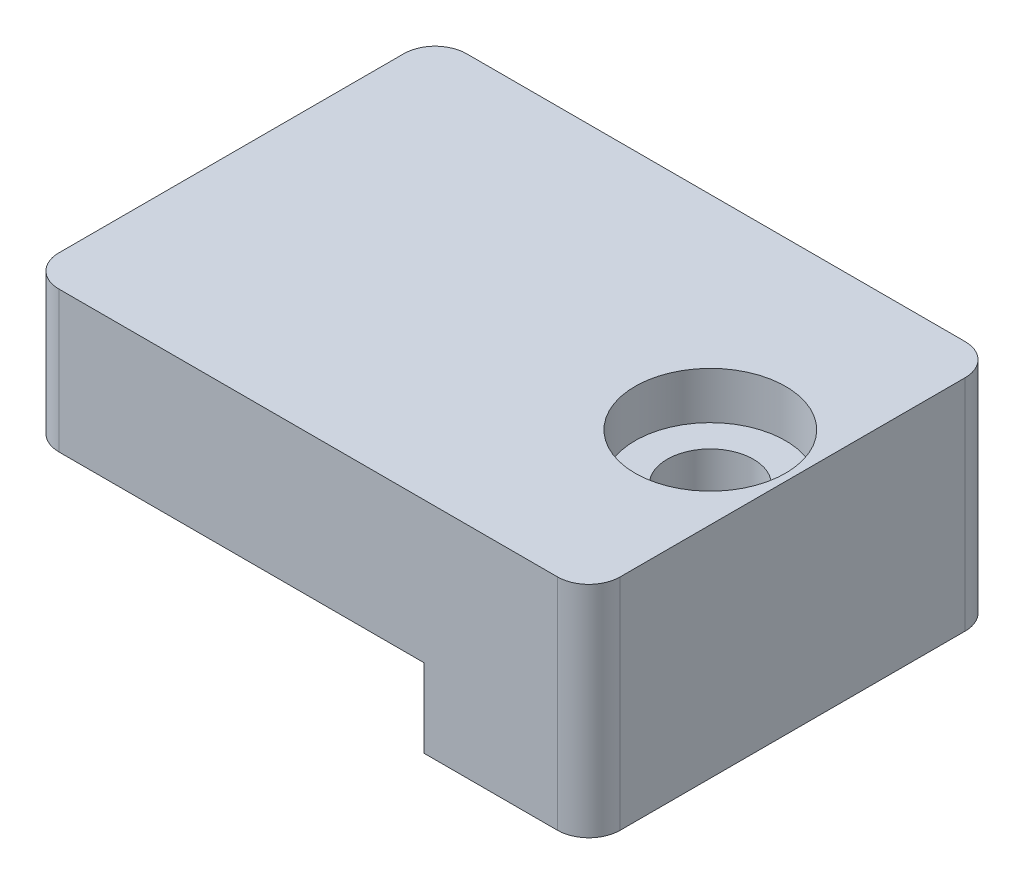
ISO-10303-21;
HEADER;
FILE_DESCRIPTION(('STEP AP214'),'2;1');
FILE_NAME('part.step','',(''),(''),'','','');
FILE_SCHEMA(('AUTOMOTIVE_DESIGN { 1 0 10303 214 1 1 1 1 }'));
ENDSEC;
DATA;
#1=APPLICATION_CONTEXT('core data for automotive mechanical design processes');
#2=APPLICATION_PROTOCOL_DEFINITION('international standard','automotive_design',2000,#1);
#3=PRODUCT_CONTEXT('',#1,'mechanical');
#4=PRODUCT('Part','Part','',(#3));
#5=PRODUCT_RELATED_PRODUCT_CATEGORY('part','',(#4));
#6=PRODUCT_DEFINITION_FORMATION('','',#4);
#7=PRODUCT_DEFINITION_CONTEXT('part definition',#1,'design');
#8=PRODUCT_DEFINITION('design','',#6,#7);
#9=PRODUCT_DEFINITION_SHAPE('','',#8);
#10=(LENGTH_UNIT() NAMED_UNIT(*) SI_UNIT(.MILLI.,.METRE.));
#11=(NAMED_UNIT(*) PLANE_ANGLE_UNIT() SI_UNIT($,.RADIAN.));
#12=(NAMED_UNIT(*) SI_UNIT($,.STERADIAN.) SOLID_ANGLE_UNIT());
#13=UNCERTAINTY_MEASURE_WITH_UNIT(LENGTH_MEASURE(1.E-05),#10,'distance_accuracy_value','');
#14=(GEOMETRIC_REPRESENTATION_CONTEXT(3) GLOBAL_UNCERTAINTY_ASSIGNED_CONTEXT((#13)) GLOBAL_UNIT_ASSIGNED_CONTEXT((#10,
#11,#12)) REPRESENTATION_CONTEXT('',''));
#15=CARTESIAN_POINT('',(0.,0.,0.));
#16=DIRECTION('',(0.,0.,1.));
#17=DIRECTION('',(1.,0.,0.));
#18=AXIS2_PLACEMENT_3D('',#15,#16,#17);
#19=CARTESIAN_POINT('',(-25.3,-9.,26.));
#20=DIRECTION('',(0.,1.,0.));
#21=DIRECTION('',(0.,0.,1.));
#22=AXIS2_PLACEMENT_3D('',#19,#20,#21);
#23=PLANE('',#22);
#24=DIRECTION('',(0.,0.,1.));
#25=VECTOR('',#24,1.);
#26=CARTESIAN_POINT('',(-2.,-9.,0.));
#27=LINE('',#26,#25);
#28=CARTESIAN_POINT('',(-2.,-9.,8.175));
#29=VERTEX_POINT('',#28);
#30=CARTESIAN_POINT('',(-2.,-9.,17.825));
#31=VERTEX_POINT('',#30);
#32=EDGE_CURVE('E350',#29,#31,#27,.T.);
#33=ORIENTED_EDGE('',*,*,#32,.F.);
#34=CARTESIAN_POINT('',(-5.175,-9.,8.175));
#35=DIRECTION('',(0.,1.,0.));
#36=DIRECTION('',(0.,0.,1.));
#37=AXIS2_PLACEMENT_3D('',#34,#35,#36);
#38=CIRCLE('',#37,3.175);
#39=CARTESIAN_POINT('',(-5.175,-9.,5.));
#40=VERTEX_POINT('',#39);
#41=EDGE_CURVE('E72',#29,#40,#38,.T.);
#42=ORIENTED_EDGE('',*,*,#41,.T.);
#43=DIRECTION('',(-1.,0.,0.));
#44=VECTOR('',#43,1.);
#45=CARTESIAN_POINT('',(-2.,-9.,5.));
#46=LINE('',#45,#44);
#47=CARTESIAN_POINT('',(-25.3,-9.,5.));
#48=VERTEX_POINT('',#47);
#49=EDGE_CURVE('E347',#40,#48,#46,.T.);
#50=ORIENTED_EDGE('',*,*,#49,.T.);
#51=DIRECTION('',(0.,0.,-1.));
#52=VECTOR('',#51,1.);
#53=CARTESIAN_POINT('',(-25.3,-9.,26.));
#54=LINE('',#53,#52);
#55=CARTESIAN_POINT('',(-25.3,-9.,2.00000000000001));
#56=VERTEX_POINT('',#55);
#57=EDGE_CURVE('E238',#48,#56,#54,.T.);
#58=ORIENTED_EDGE('',*,*,#57,.T.);
#59=CARTESIAN_POINT('',(-23.3,-9.,2.));
#60=DIRECTION('',(0.,1.,0.));
#61=DIRECTION('',(0.,0.,1.));
#62=AXIS2_PLACEMENT_3D('',#59,#60,#61);
#63=CIRCLE('',#62,2.);
#64=CARTESIAN_POINT('',(-23.3,-9.,0.));
#65=VERTEX_POINT('',#64);
#66=EDGE_CURVE('E296',#56,#65,#63,.F.);
#67=ORIENTED_EDGE('',*,*,#66,.T.);
#68=DIRECTION('',(1.,0.,0.));
#69=VECTOR('',#68,1.);
#70=CARTESIAN_POINT('',(-25.3,-9.,0.));
#71=LINE('',#70,#69);
#72=CARTESIAN_POINT('',(0.,-9.,0.));
#73=VERTEX_POINT('',#72);
#74=EDGE_CURVE('E431',#65,#73,#71,.T.);
#75=ORIENTED_EDGE('',*,*,#74,.T.);
#76=DIRECTION('',(0.,0.,-1.));
#77=VECTOR('',#76,1.);
#78=CARTESIAN_POINT('',(0.,-9.,26.));
#79=LINE('',#78,#77);
#80=CARTESIAN_POINT('',(0.,-9.,26.));
#81=VERTEX_POINT('',#80);
#82=EDGE_CURVE('E245',#81,#73,#79,.T.);
#83=ORIENTED_EDGE('',*,*,#82,.F.);
#84=DIRECTION('',(1.,0.,0.));
#85=VECTOR('',#84,1.);
#86=CARTESIAN_POINT('',(-25.3,-9.,26.));
#87=LINE('',#86,#85);
#88=CARTESIAN_POINT('',(-23.3,-9.,26.));
#89=VERTEX_POINT('',#88);
#90=EDGE_CURVE('E436',#89,#81,#87,.T.);
#91=ORIENTED_EDGE('',*,*,#90,.F.);
#92=CARTESIAN_POINT('',(-23.3,-9.,24.));
#93=DIRECTION('',(0.,1.,0.));
#94=DIRECTION('',(0.,0.,1.));
#95=AXIS2_PLACEMENT_3D('',#92,#93,#94);
#96=CIRCLE('',#95,2.);
#97=CARTESIAN_POINT('',(-25.3,-9.,24.));
#98=VERTEX_POINT('',#97);
#99=EDGE_CURVE('E235',#89,#98,#96,.F.);
#100=ORIENTED_EDGE('',*,*,#99,.T.);
#101=CARTESIAN_POINT('',(-25.3,-9.,21.));
#102=VERTEX_POINT('',#101);
#103=EDGE_CURVE('E225',#98,#102,#54,.T.);
#104=ORIENTED_EDGE('',*,*,#103,.T.);
#105=DIRECTION('',(-1.,0.,0.));
#106=VECTOR('',#105,1.);
#107=CARTESIAN_POINT('',(-2.,-9.,21.));
#108=LINE('',#107,#106);
#109=CARTESIAN_POINT('',(-5.175,-9.,21.));
#110=VERTEX_POINT('',#109);
#111=EDGE_CURVE('E210',#110,#102,#108,.T.);
#112=ORIENTED_EDGE('',*,*,#111,.F.);
#113=CARTESIAN_POINT('',(-5.175,-9.,17.825));
#114=DIRECTION('',(0.,1.,0.));
#115=DIRECTION('',(0.,0.,1.));
#116=AXIS2_PLACEMENT_3D('',#113,#114,#115);
#117=CIRCLE('',#116,3.175);
#118=EDGE_CURVE('E12',#110,#31,#117,.T.);
#119=ORIENTED_EDGE('',*,*,#118,.T.);
#120=EDGE_LOOP('',(#33,#42,#50,#58,#67,#75,#83,#91,#100,#104,#112,#119));
#121=FACE_BOUND('',#120,.T.);
#122=ADVANCED_FACE('F63',(#121),#23,.F.);
#123=CARTESIAN_POINT('',(-25.3,0.,26.));
#124=DIRECTION('',(1.,0.,0.));
#125=DIRECTION('',(0.,0.,-1.));
#126=AXIS2_PLACEMENT_3D('',#123,#124,#125);
#127=PLANE('',#126);
#128=DIRECTION('',(0.,0.,1.));
#129=VECTOR('',#128,1.);
#130=CARTESIAN_POINT('',(-25.3,-6.45,0.));
#131=LINE('',#130,#129);
#132=CARTESIAN_POINT('',(-25.3,-6.45,17.375));
#133=VERTEX_POINT('',#132);
#134=CARTESIAN_POINT('',(-25.3,-6.45,21.));
#135=VERTEX_POINT('',#134);
#136=EDGE_CURVE('E229',#133,#135,#131,.T.);
#137=ORIENTED_EDGE('',*,*,#136,.T.);
#138=DIRECTION('',(0.,1.,0.));
#139=VECTOR('',#138,1.);
#140=CARTESIAN_POINT('',(-25.3,0.,21.));
#141=LINE('',#140,#139);
#142=EDGE_CURVE('E213',#102,#135,#141,.T.);
#143=ORIENTED_EDGE('',*,*,#142,.F.);
#144=ORIENTED_EDGE('',*,*,#103,.F.);
#145=DIRECTION('',(0.,-1.,0.));
#146=VECTOR('',#145,1.);
#147=CARTESIAN_POINT('',(-25.3,0.,24.));
#148=LINE('',#147,#146);
#149=CARTESIAN_POINT('',(-25.3,0.,24.));
#150=VERTEX_POINT('',#149);
#151=EDGE_CURVE('E287',#98,#150,#148,.F.);
#152=ORIENTED_EDGE('',*,*,#151,.T.);
#153=DIRECTION('',(0.,0.,-1.));
#154=VECTOR('',#153,1.);
#155=CARTESIAN_POINT('',(-25.3,0.,26.));
#156=LINE('',#155,#154);
#157=CARTESIAN_POINT('',(-25.3,0.,2.00000000000001));
#158=VERTEX_POINT('',#157);
#159=EDGE_CURVE('E237',#150,#158,#156,.T.);
#160=ORIENTED_EDGE('',*,*,#159,.T.);
#161=DIRECTION('',(0.,-1.,0.));
#162=VECTOR('',#161,1.);
#163=CARTESIAN_POINT('',(-25.3,0.,2.));
#164=LINE('',#163,#162);
#165=EDGE_CURVE('E290',#158,#56,#164,.T.);
#166=ORIENTED_EDGE('',*,*,#165,.T.);
#167=ORIENTED_EDGE('',*,*,#57,.F.);
#168=DIRECTION('',(0.,1.,0.));
#169=VECTOR('',#168,1.);
#170=CARTESIAN_POINT('',(-25.3,0.,5.));
#171=LINE('',#170,#169);
#172=CARTESIAN_POINT('',(-25.3,-6.45,5.));
#173=VERTEX_POINT('',#172);
#174=EDGE_CURVE('E358',#48,#173,#171,.T.);
#175=ORIENTED_EDGE('',*,*,#174,.T.);
#176=CARTESIAN_POINT('',(-25.3,-6.45,8.625));
#177=VERTEX_POINT('',#176);
#178=EDGE_CURVE('E380',#173,#177,#131,.T.);
#179=ORIENTED_EDGE('',*,*,#178,.T.);
#180=DIRECTION('',(0.,1.,0.));
#181=VECTOR('',#180,1.);
#182=CARTESIAN_POINT('',(-25.3,-6.45,8.625));
#183=LINE('',#182,#181);
#184=CARTESIAN_POINT('',(-25.3,-2.25,8.625));
#185=VERTEX_POINT('',#184);
#186=EDGE_CURVE('E396',#177,#185,#183,.T.);
#187=ORIENTED_EDGE('',*,*,#186,.T.);
#188=DIRECTION('',(0.,0.,1.));
#189=VECTOR('',#188,1.);
#190=CARTESIAN_POINT('',(-25.3,-2.25,8.625));
#191=LINE('',#190,#189);
#192=CARTESIAN_POINT('',(-25.3,-2.25,17.375));
#193=VERTEX_POINT('',#192);
#194=EDGE_CURVE('E400',#185,#193,#191,.T.);
#195=ORIENTED_EDGE('',*,*,#194,.T.);
#196=DIRECTION('',(0.,-1.,0.));
#197=VECTOR('',#196,1.);
#198=CARTESIAN_POINT('',(-25.3,-2.25,17.375));
#199=LINE('',#198,#197);
#200=EDGE_CURVE('E395',#193,#133,#199,.T.);
#201=ORIENTED_EDGE('',*,*,#200,.T.);
#202=EDGE_LOOP('',(#137,#143,#144,#152,#160,#166,#167,#175,#179,#187,#195,#201));
#203=FACE_BOUND('',#202,.T.);
#204=ADVANCED_FACE('F224',(#203),#127,.F.);
#205=CARTESIAN_POINT('',(0.,-9.,26.));
#206=DIRECTION('',(1.,0.,0.));
#207=DIRECTION('',(0.,1.,0.));
#208=AXIS2_PLACEMENT_3D('',#205,#206,#207);
#209=PLANE('',#208);
#210=DIRECTION('',(0.,-1.,0.));
#211=VECTOR('',#210,1.);
#212=CARTESIAN_POINT('',(0.,-9.,0.));
#213=LINE('',#212,#211);
#214=CARTESIAN_POINT('',(0.,-14.,0.));
#215=VERTEX_POINT('',#214);
#216=EDGE_CURVE('E450',#73,#215,#213,.T.);
#217=ORIENTED_EDGE('',*,*,#216,.T.);
#218=DIRECTION('',(0.,0.,-1.));
#219=VECTOR('',#218,1.);
#220=CARTESIAN_POINT('',(0.,-14.,26.));
#221=LINE('',#220,#219);
#222=CARTESIAN_POINT('',(0.,-14.,26.));
#223=VERTEX_POINT('',#222);
#224=EDGE_CURVE('E466',#223,#215,#221,.T.);
#225=ORIENTED_EDGE('',*,*,#224,.F.);
#226=DIRECTION('',(0.,-1.,0.));
#227=VECTOR('',#226,1.);
#228=CARTESIAN_POINT('',(0.,-9.,26.));
#229=LINE('',#228,#227);
#230=EDGE_CURVE('E440',#81,#223,#229,.T.);
#231=ORIENTED_EDGE('',*,*,#230,.F.);
#232=ORIENTED_EDGE('',*,*,#82,.T.);
#233=EDGE_LOOP('',(#217,#225,#231,#232));
#234=FACE_BOUND('',#233,.T.);
#235=ADVANCED_FACE('F479',(#234),#209,.F.);
#236=CARTESIAN_POINT('',(0.,-14.,26.));
#237=DIRECTION('',(0.,1.,0.));
#238=DIRECTION('',(0.,0.,1.));
#239=AXIS2_PLACEMENT_3D('',#236,#237,#238);
#240=PLANE('',#239);
#241=CARTESIAN_POINT('',(5.25,-14.,13.));
#242=DIRECTION('',(0.,1.,0.));
#243=DIRECTION('',(0.,0.,1.));
#244=AXIS2_PLACEMENT_3D('',#241,#242,#243);
#245=CIRCLE('',#244,2.74999999999999);
#246=CARTESIAN_POINT('',(5.25,-14.,15.75));
#247=VERTEX_POINT('',#246);
#248=EDGE_CURVE('E427',#247,#247,#245,.T.);
#249=ORIENTED_EDGE('',*,*,#248,.T.);
#250=EDGE_LOOP('',(#249));
#251=FACE_BOUND('',#250,.T.);
#252=DIRECTION('',(0.,0.,-1.));
#253=VECTOR('',#252,1.);
#254=CARTESIAN_POINT('',(10.5,-14.,26.));
#255=LINE('',#254,#253);
#256=CARTESIAN_POINT('',(10.5,-14.,24.));
#257=VERTEX_POINT('',#256);
#258=CARTESIAN_POINT('',(10.5,-14.,2.00000000000001));
#259=VERTEX_POINT('',#258);
#260=EDGE_CURVE('E463',#257,#259,#255,.T.);
#261=ORIENTED_EDGE('',*,*,#260,.F.);
#262=CARTESIAN_POINT('',(8.5,-14.,24.));
#263=DIRECTION('',(0.,1.,0.));
#264=DIRECTION('',(0.,0.,1.));
#265=AXIS2_PLACEMENT_3D('',#262,#263,#264);
#266=CIRCLE('',#265,2.);
#267=CARTESIAN_POINT('',(8.5,-14.,26.));
#268=VERTEX_POINT('',#267);
#269=EDGE_CURVE('E278',#257,#268,#266,.F.);
#270=ORIENTED_EDGE('',*,*,#269,.T.);
#271=DIRECTION('',(1.,0.,0.));
#272=VECTOR('',#271,1.);
#273=CARTESIAN_POINT('',(0.,-14.,26.));
#274=LINE('',#273,#272);
#275=EDGE_CURVE('E443',#223,#268,#274,.T.);
#276=ORIENTED_EDGE('',*,*,#275,.F.);
#277=ORIENTED_EDGE('',*,*,#224,.T.);
#278=DIRECTION('',(1.,0.,0.));
#279=VECTOR('',#278,1.);
#280=CARTESIAN_POINT('',(0.,-14.,0.));
#281=LINE('',#280,#279);
#282=CARTESIAN_POINT('',(8.5,-14.,0.));
#283=VERTEX_POINT('',#282);
#284=EDGE_CURVE('E453',#215,#283,#281,.T.);
#285=ORIENTED_EDGE('',*,*,#284,.T.);
#286=CARTESIAN_POINT('',(8.5,-14.,2.));
#287=DIRECTION('',(0.,1.,0.));
#288=DIRECTION('',(0.,0.,1.));
#289=AXIS2_PLACEMENT_3D('',#286,#287,#288);
#290=CIRCLE('',#289,2.);
#291=EDGE_CURVE('E275',#283,#259,#290,.F.);
#292=ORIENTED_EDGE('',*,*,#291,.T.);
#293=EDGE_LOOP('',(#261,#270,#276,#277,#285,#292));
#294=FACE_BOUND('',#293,.T.);
#295=ADVANCED_FACE('F488',(#251,#294),#240,.F.);
#296=CARTESIAN_POINT('',(10.5,-14.,26.));
#297=DIRECTION('',(-1.,0.,0.));
#298=DIRECTION('',(0.,0.,1.));
#299=AXIS2_PLACEMENT_3D('',#296,#297,#298);
#300=PLANE('',#299);
#301=DIRECTION('',(0.,0.,-1.));
#302=VECTOR('',#301,1.);
#303=CARTESIAN_POINT('',(10.5,0.,26.));
#304=LINE('',#303,#302);
#305=CARTESIAN_POINT('',(10.5,0.,24.));
#306=VERTEX_POINT('',#305);
#307=CARTESIAN_POINT('',(10.5,0.,2.00000000000001));
#308=VERTEX_POINT('',#307);
#309=EDGE_CURVE('E447',#306,#308,#304,.T.);
#310=ORIENTED_EDGE('',*,*,#309,.F.);
#311=DIRECTION('',(0.,1.,0.));
#312=VECTOR('',#311,1.);
#313=CARTESIAN_POINT('',(10.5,-14.,24.));
#314=LINE('',#313,#312);
#315=EDGE_CURVE('E272',#306,#257,#314,.F.);
#316=ORIENTED_EDGE('',*,*,#315,.T.);
#317=ORIENTED_EDGE('',*,*,#260,.T.);
#318=DIRECTION('',(0.,1.,0.));
#319=VECTOR('',#318,1.);
#320=CARTESIAN_POINT('',(10.5,-14.,2.));
#321=LINE('',#320,#319);
#322=EDGE_CURVE('E268',#259,#308,#321,.T.);
#323=ORIENTED_EDGE('',*,*,#322,.T.);
#324=EDGE_LOOP('',(#310,#316,#317,#323));
#325=FACE_BOUND('',#324,.T.);
#326=ADVANCED_FACE('F494',(#325),#300,.F.);
#327=CARTESIAN_POINT('',(10.5,0.,26.));
#328=DIRECTION('',(0.,-1.,0.));
#329=DIRECTION('',(1.,0.,0.));
#330=AXIS2_PLACEMENT_3D('',#327,#328,#329);
#331=PLANE('',#330);
#332=CARTESIAN_POINT('',(5.25,0.,13.));
#333=DIRECTION('',(0.,1.,0.));
#334=DIRECTION('',(0.,0.,1.));
#335=AXIS2_PLACEMENT_3D('',#332,#333,#334);
#336=CIRCLE('',#335,4.8);
#337=CARTESIAN_POINT('',(5.25,0.,17.8));
#338=VERTEX_POINT('',#337);
#339=EDGE_CURVE('E409',#338,#338,#336,.T.);
#340=ORIENTED_EDGE('',*,*,#339,.F.);
#341=EDGE_LOOP('',(#340));
#342=FACE_BOUND('',#341,.T.);
#343=DIRECTION('',(-1.,0.,0.));
#344=VECTOR('',#343,1.);
#345=CARTESIAN_POINT('',(0.,0.,26.));
#346=LINE('',#345,#344);
#347=CARTESIAN_POINT('',(8.5,0.,26.));
#348=VERTEX_POINT('',#347);
#349=CARTESIAN_POINT('',(-23.3,0.,26.));
#350=VERTEX_POINT('',#349);
#351=EDGE_CURVE('E432',#348,#350,#346,.T.);
#352=ORIENTED_EDGE('',*,*,#351,.F.);
#353=CARTESIAN_POINT('',(8.5,0.,24.));
#354=DIRECTION('',(0.,-1.,0.));
#355=DIRECTION('',(1.,0.,0.));
#356=AXIS2_PLACEMENT_3D('',#353,#354,#355);
#357=CIRCLE('',#356,2.);
#358=EDGE_CURVE('E265',#348,#306,#357,.F.);
#359=ORIENTED_EDGE('',*,*,#358,.T.);
#360=ORIENTED_EDGE('',*,*,#309,.T.);
#361=CARTESIAN_POINT('',(8.5,0.,2.));
#362=DIRECTION('',(0.,-1.,0.));
#363=DIRECTION('',(1.,0.,0.));
#364=AXIS2_PLACEMENT_3D('',#361,#362,#363);
#365=CIRCLE('',#364,2.);
#366=CARTESIAN_POINT('',(8.5,0.,0.));
#367=VERTEX_POINT('',#366);
#368=EDGE_CURVE('E262',#308,#367,#365,.F.);
#369=ORIENTED_EDGE('',*,*,#368,.T.);
#370=DIRECTION('',(-1.,0.,0.));
#371=VECTOR('',#370,1.);
#372=CARTESIAN_POINT('',(10.5,0.,0.));
#373=LINE('',#372,#371);
#374=CARTESIAN_POINT('',(-23.3,0.,0.));
#375=VERTEX_POINT('',#374);
#376=EDGE_CURVE('E437',#367,#375,#373,.T.);
#377=ORIENTED_EDGE('',*,*,#376,.T.);
#378=CARTESIAN_POINT('',(-23.3,0.,2.));
#379=DIRECTION('',(0.,-1.,0.));
#380=DIRECTION('',(1.,0.,0.));
#381=AXIS2_PLACEMENT_3D('',#378,#379,#380);
#382=CIRCLE('',#381,2.);
#383=EDGE_CURVE('E259',#375,#158,#382,.F.);
#384=ORIENTED_EDGE('',*,*,#383,.T.);
#385=ORIENTED_EDGE('',*,*,#159,.F.);
#386=CARTESIAN_POINT('',(-23.3,0.,24.));
#387=DIRECTION('',(0.,-1.,0.));
#388=DIRECTION('',(1.,0.,0.));
#389=AXIS2_PLACEMENT_3D('',#386,#387,#388);
#390=CIRCLE('',#389,2.);
#391=EDGE_CURVE('E256',#150,#350,#390,.F.);
#392=ORIENTED_EDGE('',*,*,#391,.T.);
#393=EDGE_LOOP('',(#352,#359,#360,#369,#377,#384,#385,#392));
#394=FACE_BOUND('',#393,.T.);
#395=ADVANCED_FACE('F498',(#342,#394),#331,.F.);
#396=CARTESIAN_POINT('',(0.,0.,26.));
#397=DIRECTION('',(0.,0.,1.));
#398=DIRECTION('',(1.,0.,0.));
#399=AXIS2_PLACEMENT_3D('',#396,#397,#398);
#400=PLANE('',#399);
#401=ORIENTED_EDGE('',*,*,#275,.T.);
#402=DIRECTION('',(0.,1.,0.));
#403=VECTOR('',#402,1.);
#404=CARTESIAN_POINT('',(8.5,0.,26.));
#405=LINE('',#404,#403);
#406=EDGE_CURVE('E252',#268,#348,#405,.T.);
#407=ORIENTED_EDGE('',*,*,#406,.T.);
#408=ORIENTED_EDGE('',*,*,#351,.T.);
#409=DIRECTION('',(0.,-1.,0.));
#410=VECTOR('',#409,1.);
#411=CARTESIAN_POINT('',(-23.3,-9.,26.));
#412=LINE('',#411,#410);
#413=EDGE_CURVE('E243',#350,#89,#412,.T.);
#414=ORIENTED_EDGE('',*,*,#413,.T.);
#415=ORIENTED_EDGE('',*,*,#90,.T.);
#416=ORIENTED_EDGE('',*,*,#230,.T.);
#417=EDGE_LOOP('',(#401,#407,#408,#414,#415,#416));
#418=FACE_BOUND('',#417,.T.);
#419=ADVANCED_FACE('F504',(#418),#400,.T.);
#420=CARTESIAN_POINT('',(0.,0.,0.));
#421=DIRECTION('',(0.,0.,1.));
#422=DIRECTION('',(1.,0.,0.));
#423=AXIS2_PLACEMENT_3D('',#420,#421,#422);
#424=PLANE('',#423);
#425=ORIENTED_EDGE('',*,*,#376,.F.);
#426=DIRECTION('',(0.,1.,0.));
#427=VECTOR('',#426,1.);
#428=CARTESIAN_POINT('',(8.5,0.,0.));
#429=LINE('',#428,#427);
#430=EDGE_CURVE('E284',#367,#283,#429,.F.);
#431=ORIENTED_EDGE('',*,*,#430,.T.);
#432=ORIENTED_EDGE('',*,*,#284,.F.);
#433=ORIENTED_EDGE('',*,*,#216,.F.);
#434=ORIENTED_EDGE('',*,*,#74,.F.);
#435=DIRECTION('',(0.,-1.,0.));
#436=VECTOR('',#435,1.);
#437=CARTESIAN_POINT('',(-23.3,0.,0.));
#438=LINE('',#437,#436);
#439=EDGE_CURVE('E281',#65,#375,#438,.F.);
#440=ORIENTED_EDGE('',*,*,#439,.T.);
#441=EDGE_LOOP('',(#425,#431,#432,#433,#434,#440));
#442=FACE_BOUND('',#441,.T.);
#443=ADVANCED_FACE('F483',(#442),#424,.F.);
#444=CARTESIAN_POINT('',(8.5,0.,24.));
#445=DIRECTION('',(0.,-1.,0.));
#446=DIRECTION('',(0.,0.,-1.));
#447=AXIS2_PLACEMENT_3D('',#444,#445,#446);
#448=CYLINDRICAL_SURFACE('',#447,2.);
#449=ORIENTED_EDGE('',*,*,#269,.F.);
#450=ORIENTED_EDGE('',*,*,#315,.F.);
#451=ORIENTED_EDGE('',*,*,#358,.F.);
#452=ORIENTED_EDGE('',*,*,#406,.F.);
#453=EDGE_LOOP('',(#449,#450,#451,#452));
#454=FACE_BOUND('',#453,.T.);
#455=ADVANCED_FACE('F502',(#454),#448,.T.);
#456=CARTESIAN_POINT('',(8.5,-14.,2.));
#457=DIRECTION('',(0.,1.,0.));
#458=DIRECTION('',(0.,0.,1.));
#459=AXIS2_PLACEMENT_3D('',#456,#457,#458);
#460=CYLINDRICAL_SURFACE('',#459,2.);
#461=ORIENTED_EDGE('',*,*,#291,.F.);
#462=ORIENTED_EDGE('',*,*,#430,.F.);
#463=ORIENTED_EDGE('',*,*,#368,.F.);
#464=ORIENTED_EDGE('',*,*,#322,.F.);
#465=EDGE_LOOP('',(#461,#462,#463,#464));
#466=FACE_BOUND('',#465,.T.);
#467=ADVANCED_FACE('F491',(#466),#460,.T.);
#468=CARTESIAN_POINT('',(-23.3,0.,2.));
#469=DIRECTION('',(0.,-1.,0.));
#470=DIRECTION('',(0.,0.,-1.));
#471=AXIS2_PLACEMENT_3D('',#468,#469,#470);
#472=CYLINDRICAL_SURFACE('',#471,2.);
#473=ORIENTED_EDGE('',*,*,#383,.F.);
#474=ORIENTED_EDGE('',*,*,#439,.F.);
#475=ORIENTED_EDGE('',*,*,#66,.F.);
#476=ORIENTED_EDGE('',*,*,#165,.F.);
#477=EDGE_LOOP('',(#473,#474,#475,#476));
#478=FACE_BOUND('',#477,.T.);
#479=ADVANCED_FACE('F513',(#478),#472,.T.);
#480=CARTESIAN_POINT('',(-23.3,0.,24.));
#481=DIRECTION('',(0.,1.,0.));
#482=DIRECTION('',(0.,0.,1.));
#483=AXIS2_PLACEMENT_3D('',#480,#481,#482);
#484=CYLINDRICAL_SURFACE('',#483,2.);
#485=ORIENTED_EDGE('',*,*,#391,.F.);
#486=ORIENTED_EDGE('',*,*,#151,.F.);
#487=ORIENTED_EDGE('',*,*,#99,.F.);
#488=ORIENTED_EDGE('',*,*,#413,.F.);
#489=EDGE_LOOP('',(#485,#486,#487,#488));
#490=FACE_BOUND('',#489,.T.);
#491=ADVANCED_FACE('F508',(#490),#484,.T.);
#492=CARTESIAN_POINT('',(5.25,0.,13.));
#493=DIRECTION('',(0.,1.,0.));
#494=DIRECTION('',(0.,0.,1.));
#495=AXIS2_PLACEMENT_3D('',#492,#493,#494);
#496=CYLINDRICAL_SURFACE('',#495,2.75);
#497=ORIENTED_EDGE('',*,*,#248,.F.);
#498=EDGE_LOOP('',(#497));
#499=FACE_BOUND('',#498,.T.);
#500=CARTESIAN_POINT('',(5.25,-3.,13.));
#501=DIRECTION('',(0.,1.,0.));
#502=DIRECTION('',(0.,0.,1.));
#503=AXIS2_PLACEMENT_3D('',#500,#501,#502);
#504=CIRCLE('',#503,2.75);
#505=CARTESIAN_POINT('',(5.25,-3.,15.75));
#506=VERTEX_POINT('',#505);
#507=EDGE_CURVE('E423',#506,#506,#504,.T.);
#508=ORIENTED_EDGE('',*,*,#507,.T.);
#509=EDGE_LOOP('',(#508));
#510=FACE_BOUND('',#509,.T.);
#511=ADVANCED_FACE('F557',(#499,#510),#496,.F.);
#512=CARTESIAN_POINT('',(8.,-3.,13.));
#513=DIRECTION('',(0.,-1.,0.));
#514=DIRECTION('',(0.,0.,-1.));
#515=AXIS2_PLACEMENT_3D('',#512,#513,#514);
#516=PLANE('',#515);
#517=ORIENTED_EDGE('',*,*,#507,.F.);
#518=EDGE_LOOP('',(#517));
#519=FACE_BOUND('',#518,.T.);
#520=CARTESIAN_POINT('',(5.25,-3.,13.));
#521=DIRECTION('',(0.,1.,0.));
#522=DIRECTION('',(0.,0.,1.));
#523=AXIS2_PLACEMENT_3D('',#520,#521,#522);
#524=CIRCLE('',#523,4.8);
#525=CARTESIAN_POINT('',(5.25,-3.,17.8));
#526=VERTEX_POINT('',#525);
#527=EDGE_CURVE('E419',#526,#526,#524,.T.);
#528=ORIENTED_EDGE('',*,*,#527,.T.);
#529=EDGE_LOOP('',(#528));
#530=FACE_BOUND('',#529,.T.);
#531=ADVANCED_FACE('F670',(#519,#530),#516,.F.);
#532=CARTESIAN_POINT('',(5.25,0.,13.));
#533=DIRECTION('',(0.,1.,0.));
#534=DIRECTION('',(0.,0.,1.));
#535=AXIS2_PLACEMENT_3D('',#532,#533,#534);
#536=CYLINDRICAL_SURFACE('',#535,4.8);
#537=ORIENTED_EDGE('',*,*,#527,.F.);
#538=EDGE_LOOP('',(#537));
#539=FACE_BOUND('',#538,.T.);
#540=ORIENTED_EDGE('',*,*,#339,.T.);
#541=EDGE_LOOP('',(#540));
#542=FACE_BOUND('',#541,.T.);
#543=ADVANCED_FACE('F648',(#539,#542),#536,.F.);
#544=CARTESIAN_POINT('',(-2.,0.,5.));
#545=DIRECTION('',(0.,0.,1.));
#546=DIRECTION('',(1.,0.,0.));
#547=AXIS2_PLACEMENT_3D('',#544,#545,#546);
#548=PLANE('',#547);
#549=ORIENTED_EDGE('',*,*,#49,.F.);
#550=DIRECTION('',(0.,1.,0.));
#551=VECTOR('',#550,1.);
#552=CARTESIAN_POINT('',(-5.175,-6.45,5.));
#553=LINE('',#552,#551);
#554=CARTESIAN_POINT('',(-5.175,-6.45,5.));
#555=VERTEX_POINT('',#554);
#556=EDGE_CURVE('E327',#40,#555,#553,.T.);
#557=ORIENTED_EDGE('',*,*,#556,.T.);
#558=DIRECTION('',(-1.,0.,0.));
#559=VECTOR('',#558,1.);
#560=CARTESIAN_POINT('',(-2.,-6.45,5.));
#561=LINE('',#560,#559);
#562=EDGE_CURVE('E362',#555,#173,#561,.T.);
#563=ORIENTED_EDGE('',*,*,#562,.T.);
#564=ORIENTED_EDGE('',*,*,#174,.F.);
#565=EDGE_LOOP('',(#549,#557,#563,#564));
#566=FACE_BOUND('',#565,.T.);
#567=ADVANCED_FACE('F355',(#566),#548,.T.);
#568=CARTESIAN_POINT('',(-2.,0.,21.));
#569=DIRECTION('',(0.,0.,1.));
#570=DIRECTION('',(1.,0.,0.));
#571=AXIS2_PLACEMENT_3D('',#568,#569,#570);
#572=PLANE('',#571);
#573=DIRECTION('',(-1.,0.,0.));
#574=VECTOR('',#573,1.);
#575=CARTESIAN_POINT('',(-2.,-6.45,21.));
#576=LINE('',#575,#574);
#577=CARTESIAN_POINT('',(-5.175,-6.45,21.));
#578=VERTEX_POINT('',#577);
#579=EDGE_CURVE('E219',#578,#135,#576,.T.);
#580=ORIENTED_EDGE('',*,*,#579,.F.);
#581=DIRECTION('',(0.,1.,0.));
#582=VECTOR('',#581,1.);
#583=CARTESIAN_POINT('',(-5.175,0.,21.));
#584=LINE('',#583,#582);
#585=EDGE_CURVE('E79',#578,#110,#584,.F.);
#586=ORIENTED_EDGE('',*,*,#585,.T.);
#587=ORIENTED_EDGE('',*,*,#111,.T.);
#588=ORIENTED_EDGE('',*,*,#142,.T.);
#589=EDGE_LOOP('',(#580,#586,#587,#588));
#590=FACE_BOUND('',#589,.T.);
#591=ADVANCED_FACE('F212',(#590),#572,.F.);
#592=CARTESIAN_POINT('',(-2.,0.,0.));
#593=DIRECTION('',(-1.,0.,0.));
#594=DIRECTION('',(0.,0.,1.));
#595=AXIS2_PLACEMENT_3D('',#592,#593,#594);
#596=PLANE('',#595);
#597=DIRECTION('',(0.,0.,1.));
#598=VECTOR('',#597,1.);
#599=CARTESIAN_POINT('',(-2.,-2.25,8.625));
#600=LINE('',#599,#598);
#601=CARTESIAN_POINT('',(-2.,-2.25,11.8));
#602=VERTEX_POINT('',#601);
#603=CARTESIAN_POINT('',(-2.,-2.25,14.2));
#604=VERTEX_POINT('',#603);
#605=EDGE_CURVE('E390',#602,#604,#600,.T.);
#606=ORIENTED_EDGE('',*,*,#605,.F.);
#607=DIRECTION('',(0.,1.,0.));
#608=VECTOR('',#607,1.);
#609=CARTESIAN_POINT('',(-2.,-6.45,11.8));
#610=LINE('',#609,#608);
#611=CARTESIAN_POINT('',(-2.,-6.45,11.8));
#612=VERTEX_POINT('',#611);
#613=EDGE_CURVE('E319',#602,#612,#610,.F.);
#614=ORIENTED_EDGE('',*,*,#613,.T.);
#615=DIRECTION('',(0.,0.,1.));
#616=VECTOR('',#615,1.);
#617=CARTESIAN_POINT('',(-2.,-6.45,0.));
#618=LINE('',#617,#616);
#619=CARTESIAN_POINT('',(-2.,-6.45,8.175));
#620=VERTEX_POINT('',#619);
#621=EDGE_CURVE('E220',#620,#612,#618,.T.);
#622=ORIENTED_EDGE('',*,*,#621,.F.);
#623=DIRECTION('',(0.,1.,0.));
#624=VECTOR('',#623,1.);
#625=CARTESIAN_POINT('',(-2.,-9.,8.175));
#626=LINE('',#625,#624);
#627=EDGE_CURVE('E313',#620,#29,#626,.F.);
#628=ORIENTED_EDGE('',*,*,#627,.T.);
#629=ORIENTED_EDGE('',*,*,#32,.T.);
#630=DIRECTION('',(0.,1.,0.));
#631=VECTOR('',#630,1.);
#632=CARTESIAN_POINT('',(-2.,0.,17.825));
#633=LINE('',#632,#631);
#634=CARTESIAN_POINT('',(-2.,-6.45,17.825));
#635=VERTEX_POINT('',#634);
#636=EDGE_CURVE('E309',#31,#635,#633,.T.);
#637=ORIENTED_EDGE('',*,*,#636,.T.);
#638=CARTESIAN_POINT('',(-2.,-6.45,14.2));
#639=VERTEX_POINT('',#638);
#640=EDGE_CURVE('E375',#639,#635,#618,.T.);
#641=ORIENTED_EDGE('',*,*,#640,.F.);
#642=DIRECTION('',(0.,-1.,0.));
#643=VECTOR('',#642,1.);
#644=CARTESIAN_POINT('',(-2.,-2.25,14.2));
#645=LINE('',#644,#643);
#646=EDGE_CURVE('E316',#639,#604,#645,.F.);
#647=ORIENTED_EDGE('',*,*,#646,.T.);
#648=EDGE_LOOP('',(#606,#614,#622,#628,#629,#637,#641,#647));
#649=FACE_BOUND('',#648,.T.);
#650=ADVANCED_FACE('F371',(#649),#596,.T.);
#651=CARTESIAN_POINT('',(-2.,-6.45,0.));
#652=DIRECTION('',(0.,-1.,0.));
#653=DIRECTION('',(0.,0.,-1.));
#654=AXIS2_PLACEMENT_3D('',#651,#652,#653);
#655=PLANE('',#654);
#656=ORIENTED_EDGE('',*,*,#640,.T.);
#657=CARTESIAN_POINT('',(-5.175,-6.45,17.825));
#658=DIRECTION('',(0.,-1.,0.));
#659=DIRECTION('',(0.,0.,-1.));
#660=AXIS2_PLACEMENT_3D('',#657,#658,#659);
#661=CIRCLE('',#660,3.175);
#662=EDGE_CURVE('E87',#635,#578,#661,.T.);
#663=ORIENTED_EDGE('',*,*,#662,.T.);
#664=ORIENTED_EDGE('',*,*,#579,.T.);
#665=ORIENTED_EDGE('',*,*,#136,.F.);
#666=DIRECTION('',(-1.,0.,0.));
#667=VECTOR('',#666,1.);
#668=CARTESIAN_POINT('',(-2.,-6.45,17.375));
#669=LINE('',#668,#667);
#670=CARTESIAN_POINT('',(-5.175,-6.45,17.375));
#671=VERTEX_POINT('',#670);
#672=EDGE_CURVE('E361',#671,#133,#669,.T.);
#673=ORIENTED_EDGE('',*,*,#672,.F.);
#674=CARTESIAN_POINT('',(-5.175,-6.45,14.2));
#675=DIRECTION('',(0.,-1.,0.));
#676=DIRECTION('',(0.,0.,-1.));
#677=AXIS2_PLACEMENT_3D('',#674,#675,#676);
#678=CIRCLE('',#677,3.175);
#679=EDGE_CURVE('E341',#671,#639,#678,.F.);
#680=ORIENTED_EDGE('',*,*,#679,.T.);
#681=EDGE_LOOP('',(#656,#663,#664,#665,#673,#680));
#682=FACE_BOUND('',#681,.T.);
#683=ADVANCED_FACE('F530',(#682),#655,.T.);
#684=ORIENTED_EDGE('',*,*,#562,.F.);
#685=CARTESIAN_POINT('',(-5.175,-6.45,8.175));
#686=DIRECTION('',(0.,-1.,0.));
#687=DIRECTION('',(0.,0.,-1.));
#688=AXIS2_PLACEMENT_3D('',#685,#686,#687);
#689=CIRCLE('',#688,3.175);
#690=EDGE_CURVE('E331',#555,#620,#689,.T.);
#691=ORIENTED_EDGE('',*,*,#690,.T.);
#692=ORIENTED_EDGE('',*,*,#621,.T.);
#693=CARTESIAN_POINT('',(-5.175,-6.45,11.8));
#694=DIRECTION('',(0.,-1.,0.));
#695=DIRECTION('',(0.,0.,-1.));
#696=AXIS2_PLACEMENT_3D('',#693,#694,#695);
#697=CIRCLE('',#696,3.175);
#698=CARTESIAN_POINT('',(-5.175,-6.45,8.625));
#699=VERTEX_POINT('',#698);
#700=EDGE_CURVE('E338',#612,#699,#697,.F.);
#701=ORIENTED_EDGE('',*,*,#700,.T.);
#702=DIRECTION('',(-1.,0.,0.));
#703=VECTOR('',#702,1.);
#704=CARTESIAN_POINT('',(-2.,-6.45,8.625));
#705=LINE('',#704,#703);
#706=EDGE_CURVE('E406',#699,#177,#705,.T.);
#707=ORIENTED_EDGE('',*,*,#706,.T.);
#708=ORIENTED_EDGE('',*,*,#178,.F.);
#709=EDGE_LOOP('',(#684,#691,#692,#701,#707,#708));
#710=FACE_BOUND('',#709,.T.);
#711=ADVANCED_FACE('F367',(#710),#655,.T.);
#712=CARTESIAN_POINT('',(-2.,-2.25,8.625));
#713=DIRECTION('',(0.,-1.,0.));
#714=DIRECTION('',(0.,0.,-1.));
#715=AXIS2_PLACEMENT_3D('',#712,#713,#714);
#716=PLANE('',#715);
#717=DIRECTION('',(-1.,0.,0.));
#718=VECTOR('',#717,1.);
#719=CARTESIAN_POINT('',(-2.,-2.25,8.625));
#720=LINE('',#719,#718);
#721=CARTESIAN_POINT('',(-5.175,-2.25,8.625));
#722=VERTEX_POINT('',#721);
#723=EDGE_CURVE('E231',#722,#185,#720,.T.);
#724=ORIENTED_EDGE('',*,*,#723,.F.);
#725=CARTESIAN_POINT('',(-5.175,-2.25,11.8));
#726=DIRECTION('',(0.,-1.,0.));
#727=DIRECTION('',(0.,0.,-1.));
#728=AXIS2_PLACEMENT_3D('',#725,#726,#727);
#729=CIRCLE('',#728,3.175);
#730=EDGE_CURVE('E306',#722,#602,#729,.T.);
#731=ORIENTED_EDGE('',*,*,#730,.T.);
#732=ORIENTED_EDGE('',*,*,#605,.T.);
#733=CARTESIAN_POINT('',(-5.175,-2.25,14.2));
#734=DIRECTION('',(0.,-1.,0.));
#735=DIRECTION('',(0.,0.,-1.));
#736=AXIS2_PLACEMENT_3D('',#733,#734,#735);
#737=CIRCLE('',#736,3.175);
#738=CARTESIAN_POINT('',(-5.175,-2.25,17.375));
#739=VERTEX_POINT('',#738);
#740=EDGE_CURVE('E303',#604,#739,#737,.T.);
#741=ORIENTED_EDGE('',*,*,#740,.T.);
#742=DIRECTION('',(-1.,0.,0.));
#743=VECTOR('',#742,1.);
#744=CARTESIAN_POINT('',(-2.,-2.25,17.375));
#745=LINE('',#744,#743);
#746=EDGE_CURVE('E394',#739,#193,#745,.T.);
#747=ORIENTED_EDGE('',*,*,#746,.T.);
#748=ORIENTED_EDGE('',*,*,#194,.F.);
#749=EDGE_LOOP('',(#724,#731,#732,#741,#747,#748));
#750=FACE_BOUND('',#749,.T.);
#751=ADVANCED_FACE('F523',(#750),#716,.T.);
#752=CARTESIAN_POINT('',(-2.,-2.25,17.375));
#753=DIRECTION('',(0.,0.,-1.));
#754=DIRECTION('',(-1.,0.,0.));
#755=AXIS2_PLACEMENT_3D('',#752,#753,#754);
#756=PLANE('',#755);
#757=ORIENTED_EDGE('',*,*,#746,.F.);
#758=DIRECTION('',(0.,-1.,0.));
#759=VECTOR('',#758,1.);
#760=CARTESIAN_POINT('',(-5.175,-6.45,17.375));
#761=LINE('',#760,#759);
#762=EDGE_CURVE('E323',#739,#671,#761,.T.);
#763=ORIENTED_EDGE('',*,*,#762,.T.);
#764=ORIENTED_EDGE('',*,*,#672,.T.);
#765=ORIENTED_EDGE('',*,*,#200,.F.);
#766=EDGE_LOOP('',(#757,#763,#764,#765));
#767=FACE_BOUND('',#766,.T.);
#768=ADVANCED_FACE('F527',(#767),#756,.T.);
#769=CARTESIAN_POINT('',(-2.,-6.45,8.625));
#770=DIRECTION('',(0.,0.,1.));
#771=DIRECTION('',(1.,0.,0.));
#772=AXIS2_PLACEMENT_3D('',#769,#770,#771);
#773=PLANE('',#772);
#774=ORIENTED_EDGE('',*,*,#706,.F.);
#775=DIRECTION('',(0.,1.,0.));
#776=VECTOR('',#775,1.);
#777=CARTESIAN_POINT('',(-5.175,-2.25,8.625));
#778=LINE('',#777,#776);
#779=EDGE_CURVE('E299',#699,#722,#778,.T.);
#780=ORIENTED_EDGE('',*,*,#779,.T.);
#781=ORIENTED_EDGE('',*,*,#723,.T.);
#782=ORIENTED_EDGE('',*,*,#186,.F.);
#783=EDGE_LOOP('',(#774,#780,#781,#782));
#784=FACE_BOUND('',#783,.T.);
#785=ADVANCED_FACE('F519',(#784),#773,.T.);
#786=CARTESIAN_POINT('',(-5.175,-6.45,11.8));
#787=DIRECTION('',(0.,-1.,0.));
#788=DIRECTION('',(0.,0.,-1.));
#789=AXIS2_PLACEMENT_3D('',#786,#787,#788);
#790=CYLINDRICAL_SURFACE('',#789,3.175);
#791=ORIENTED_EDGE('',*,*,#700,.F.);
#792=ORIENTED_EDGE('',*,*,#613,.F.);
#793=ORIENTED_EDGE('',*,*,#730,.F.);
#794=ORIENTED_EDGE('',*,*,#779,.F.);
#795=EDGE_LOOP('',(#791,#792,#793,#794));
#796=FACE_BOUND('',#795,.T.);
#797=ADVANCED_FACE('F558',(#796),#790,.F.);
#798=CARTESIAN_POINT('',(-5.175,-2.25,14.2));
#799=DIRECTION('',(0.,1.,0.));
#800=DIRECTION('',(0.,0.,1.));
#801=AXIS2_PLACEMENT_3D('',#798,#799,#800);
#802=CYLINDRICAL_SURFACE('',#801,3.175);
#803=ORIENTED_EDGE('',*,*,#740,.F.);
#804=ORIENTED_EDGE('',*,*,#646,.F.);
#805=ORIENTED_EDGE('',*,*,#679,.F.);
#806=ORIENTED_EDGE('',*,*,#762,.F.);
#807=EDGE_LOOP('',(#803,#804,#805,#806));
#808=FACE_BOUND('',#807,.T.);
#809=ADVANCED_FACE('F539',(#808),#802,.F.);
#810=CARTESIAN_POINT('',(-5.175,0.,8.175));
#811=DIRECTION('',(0.,-1.,0.));
#812=DIRECTION('',(0.,0.,-1.));
#813=AXIS2_PLACEMENT_3D('',#810,#811,#812);
#814=CYLINDRICAL_SURFACE('',#813,3.175);
#815=ORIENTED_EDGE('',*,*,#41,.F.);
#816=ORIENTED_EDGE('',*,*,#627,.F.);
#817=ORIENTED_EDGE('',*,*,#690,.F.);
#818=ORIENTED_EDGE('',*,*,#556,.F.);
#819=EDGE_LOOP('',(#815,#816,#817,#818));
#820=FACE_BOUND('',#819,.T.);
#821=ADVANCED_FACE('F364',(#820),#814,.F.);
#822=CARTESIAN_POINT('',(-5.175,0.,17.825));
#823=DIRECTION('',(0.,1.,0.));
#824=DIRECTION('',(0.,0.,1.));
#825=AXIS2_PLACEMENT_3D('',#822,#823,#824);
#826=CYLINDRICAL_SURFACE('',#825,3.175);
#827=ORIENTED_EDGE('',*,*,#118,.F.);
#828=ORIENTED_EDGE('',*,*,#585,.F.);
#829=ORIENTED_EDGE('',*,*,#662,.F.);
#830=ORIENTED_EDGE('',*,*,#636,.F.);
#831=EDGE_LOOP('',(#827,#828,#829,#830));
#832=FACE_BOUND('',#831,.T.);
#833=ADVANCED_FACE('F65',(#832),#826,.F.);
#834=CLOSED_SHELL('',(#122,#204,#235,#295,#326,#395,#419,#443,#455,#467,#479,#491,#511,#531,
#543,#567,#591,#650,#683,#711,#751,#768,#785,#797,#809,#821,#833));
#835=MANIFOLD_SOLID_BREP('B2',#834);
#836=ADVANCED_BREP_SHAPE_REPRESENTATION('',(#18,#835),#14);
#837=SHAPE_DEFINITION_REPRESENTATION(#9,#836);
ENDSEC;
END-ISO-10303-21;
